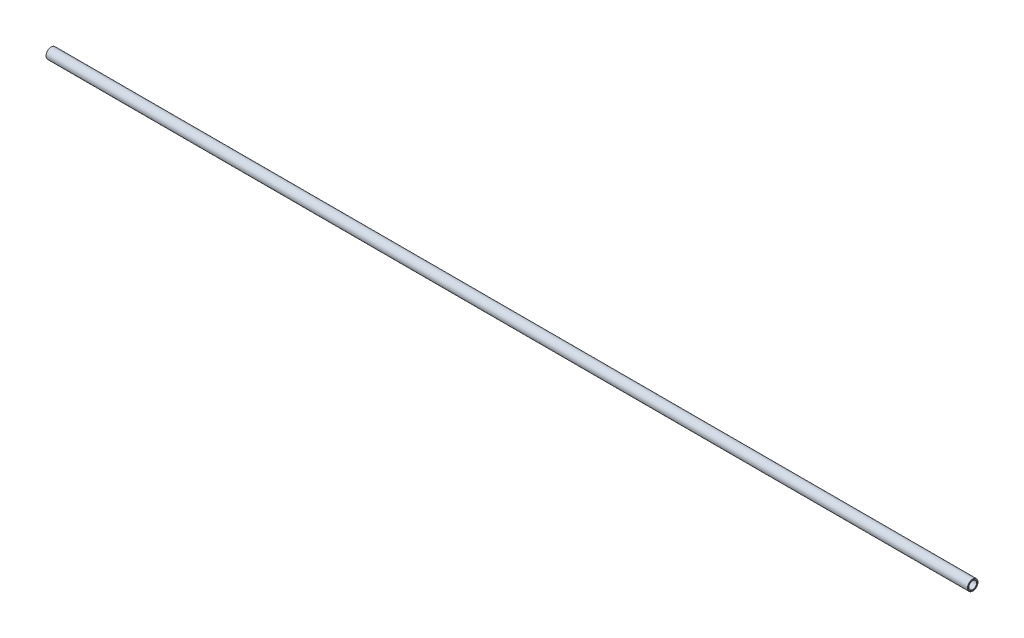
ISO-10303-21;
HEADER;
FILE_DESCRIPTION(('STEP AP214'),'2;1');
FILE_NAME('part.step','',(''),(''),'','','');
FILE_SCHEMA(('AUTOMOTIVE_DESIGN { 1 0 10303 214 1 1 1 1 }'));
ENDSEC;
DATA;
#1=APPLICATION_CONTEXT('core data for automotive mechanical design processes');
#2=APPLICATION_PROTOCOL_DEFINITION('international standard','automotive_design',2000,#1);
#3=PRODUCT_CONTEXT('',#1,'mechanical');
#4=PRODUCT('Part','Part','',(#3));
#5=PRODUCT_RELATED_PRODUCT_CATEGORY('part','',(#4));
#6=PRODUCT_DEFINITION_FORMATION('','',#4);
#7=PRODUCT_DEFINITION_CONTEXT('part definition',#1,'design');
#8=PRODUCT_DEFINITION('design','',#6,#7);
#9=PRODUCT_DEFINITION_SHAPE('','',#8);
#10=(LENGTH_UNIT() NAMED_UNIT(*) SI_UNIT(.MILLI.,.METRE.));
#11=(NAMED_UNIT(*) PLANE_ANGLE_UNIT() SI_UNIT($,.RADIAN.));
#12=(NAMED_UNIT(*) SI_UNIT($,.STERADIAN.) SOLID_ANGLE_UNIT());
#13=UNCERTAINTY_MEASURE_WITH_UNIT(LENGTH_MEASURE(1.E-05),#10,'distance_accuracy_value','');
#14=(GEOMETRIC_REPRESENTATION_CONTEXT(3) GLOBAL_UNCERTAINTY_ASSIGNED_CONTEXT((#13)) GLOBAL_UNIT_ASSIGNED_CONTEXT((#10,
#11,#12)) REPRESENTATION_CONTEXT('',''));
#15=CARTESIAN_POINT('',(0.,0.,0.));
#16=DIRECTION('',(0.,0.,1.));
#17=DIRECTION('',(1.,0.,0.));
#18=AXIS2_PLACEMENT_3D('',#15,#16,#17);
#19=CARTESIAN_POINT('',(2235.2,0.,0.));
#20=DIRECTION('',(1.,0.,0.));
#21=DIRECTION('',(0.,0.,-1.));
#22=AXIS2_PLACEMENT_3D('',#19,#20,#21);
#23=PLANE('',#22);
#24=CARTESIAN_POINT('',(2235.2,0.,0.));
#25=DIRECTION('',(1.,0.,0.));
#26=DIRECTION('',(0.,0.,-1.));
#27=AXIS2_PLACEMENT_3D('',#24,#25,#26);
#28=CIRCLE('',#27,12.192);
#29=CARTESIAN_POINT('',(2235.2,0.,-12.192));
#30=VERTEX_POINT('',#29);
#31=EDGE_CURVE('E10',#30,#30,#28,.T.);
#32=ORIENTED_EDGE('',*,*,#31,.T.);
#33=EDGE_LOOP('',(#32));
#34=FACE_BOUND('',#33,.T.);
#35=CARTESIAN_POINT('',(2235.2,0.,0.));
#36=DIRECTION('',(1.,0.,0.));
#37=DIRECTION('',(0.,0.,-1.));
#38=AXIS2_PLACEMENT_3D('',#35,#36,#37);
#39=CIRCLE('',#38,10.0330000000004);
#40=CARTESIAN_POINT('',(2235.2,0.,-10.0330000000004));
#41=VERTEX_POINT('',#40);
#42=EDGE_CURVE('E42',#41,#41,#39,.F.);
#43=ORIENTED_EDGE('',*,*,#42,.T.);
#44=EDGE_LOOP('',(#43));
#45=FACE_BOUND('',#44,.T.);
#46=ADVANCED_FACE('F34',(#34,#45),#23,.T.);
#47=CARTESIAN_POINT('',(0.,0.,0.));
#48=DIRECTION('',(1.,0.,0.));
#49=DIRECTION('',(0.,0.,-1.));
#50=AXIS2_PLACEMENT_3D('',#47,#48,#49);
#51=PLANE('',#50);
#52=CARTESIAN_POINT('',(0.,0.,0.));
#53=DIRECTION('',(1.,0.,0.));
#54=DIRECTION('',(0.,0.,-1.));
#55=AXIS2_PLACEMENT_3D('',#52,#53,#54);
#56=CIRCLE('',#55,10.0330000000002);
#57=CARTESIAN_POINT('',(0.,0.,-10.0330000000002));
#58=VERTEX_POINT('',#57);
#59=EDGE_CURVE('E61',#58,#58,#56,.T.);
#60=ORIENTED_EDGE('',*,*,#59,.T.);
#61=EDGE_LOOP('',(#60));
#62=FACE_BOUND('',#61,.T.);
#63=CARTESIAN_POINT('',(0.,0.,0.));
#64=DIRECTION('',(1.,0.,0.));
#65=DIRECTION('',(0.,0.,-1.));
#66=AXIS2_PLACEMENT_3D('',#63,#64,#65);
#67=CIRCLE('',#66,12.1919999999998);
#68=CARTESIAN_POINT('',(0.,0.,-12.1919999999998));
#69=VERTEX_POINT('',#68);
#70=EDGE_CURVE('E64',#69,#69,#67,.F.);
#71=ORIENTED_EDGE('',*,*,#70,.T.);
#72=EDGE_LOOP('',(#71));
#73=FACE_BOUND('',#72,.T.);
#74=ADVANCED_FACE('F68',(#62,#73),#51,.F.);
#75=CARTESIAN_POINT('',(2235.2,0.,0.));
#76=DIRECTION('',(-1.,0.,0.));
#77=DIRECTION('',(0.,0.,1.));
#78=AXIS2_PLACEMENT_3D('',#75,#76,#77);
#79=CYLINDRICAL_SURFACE('',#78,12.7);
#80=CARTESIAN_POINT('',(0.508000000000397,0.,0.));
#81=DIRECTION('',(1.,0.,0.));
#82=DIRECTION('',(0.,0.,-1.));
#83=AXIS2_PLACEMENT_3D('',#80,#81,#82);
#84=CIRCLE('',#83,12.7);
#85=CARTESIAN_POINT('',(0.508000000000397,0.,-12.7));
#86=VERTEX_POINT('',#85);
#87=EDGE_CURVE('E46',#86,#86,#84,.T.);
#88=ORIENTED_EDGE('',*,*,#87,.T.);
#89=EDGE_LOOP('',(#88));
#90=FACE_BOUND('',#89,.T.);
#91=CARTESIAN_POINT('',(2234.692,0.,0.));
#92=DIRECTION('',(1.,0.,0.));
#93=DIRECTION('',(0.,0.,-1.));
#94=AXIS2_PLACEMENT_3D('',#91,#92,#93);
#95=CIRCLE('',#94,12.7);
#96=CARTESIAN_POINT('',(2234.692,0.,-12.7));
#97=VERTEX_POINT('',#96);
#98=EDGE_CURVE('E50',#97,#97,#95,.F.);
#99=ORIENTED_EDGE('',*,*,#98,.T.);
#100=EDGE_LOOP('',(#99));
#101=FACE_BOUND('',#100,.T.);
#102=ADVANCED_FACE('F78',(#90,#101),#79,.T.);
#103=CARTESIAN_POINT('',(2235.2,0.,0.));
#104=DIRECTION('',(-1.,0.,0.));
#105=DIRECTION('',(0.,0.,1.));
#106=AXIS2_PLACEMENT_3D('',#103,#104,#105);
#107=CYLINDRICAL_SURFACE('',#106,9.525);
#108=CARTESIAN_POINT('',(0.507999999999953,0.,0.));
#109=DIRECTION('',(1.,0.,0.));
#110=DIRECTION('',(0.,0.,-1.));
#111=AXIS2_PLACEMENT_3D('',#108,#109,#110);
#112=CIRCLE('',#111,9.525);
#113=CARTESIAN_POINT('',(0.507999999999953,0.,-9.525));
#114=VERTEX_POINT('',#113);
#115=EDGE_CURVE('E55',#114,#114,#112,.F.);
#116=ORIENTED_EDGE('',*,*,#115,.T.);
#117=EDGE_LOOP('',(#116));
#118=FACE_BOUND('',#117,.T.);
#119=CARTESIAN_POINT('',(2234.692,0.,0.));
#120=DIRECTION('',(1.,0.,0.));
#121=DIRECTION('',(0.,0.,-1.));
#122=AXIS2_PLACEMENT_3D('',#119,#120,#121);
#123=CIRCLE('',#122,9.525);
#124=CARTESIAN_POINT('',(2234.692,0.,-9.525));
#125=VERTEX_POINT('',#124);
#126=EDGE_CURVE('E58',#125,#125,#123,.T.);
#127=ORIENTED_EDGE('',*,*,#126,.T.);
#128=EDGE_LOOP('',(#127));
#129=FACE_BOUND('',#128,.T.);
#130=ADVANCED_FACE('F81',(#118,#129),#107,.F.);
#131=CARTESIAN_POINT('',(0.,0.,0.));
#132=DIRECTION('',(-1.,0.,0.));
#133=DIRECTION('',(0.,0.,1.));
#134=AXIS2_PLACEMENT_3D('',#131,#132,#133);
#135=CONICAL_SURFACE('',#134,10.0330000000002,0.785398163397674);
#136=ORIENTED_EDGE('',*,*,#115,.F.);
#137=EDGE_LOOP('',(#136));
#138=FACE_BOUND('',#137,.T.);
#139=ORIENTED_EDGE('',*,*,#59,.F.);
#140=EDGE_LOOP('',(#139));
#141=FACE_BOUND('',#140,.T.);
#142=ADVANCED_FACE('F74',(#138,#141),#135,.F.);
#143=CARTESIAN_POINT('',(0.508000000000397,0.,0.));
#144=DIRECTION('',(1.,0.,0.));
#145=DIRECTION('',(0.,0.,-1.));
#146=AXIS2_PLACEMENT_3D('',#143,#144,#145);
#147=CONICAL_SURFACE('',#146,12.7,0.785398163397293);
#148=ORIENTED_EDGE('',*,*,#70,.F.);
#149=EDGE_LOOP('',(#148));
#150=FACE_BOUND('',#149,.T.);
#151=ORIENTED_EDGE('',*,*,#87,.F.);
#152=EDGE_LOOP('',(#151));
#153=FACE_BOUND('',#152,.T.);
#154=ADVANCED_FACE('F70',(#150,#153),#147,.T.);
#155=CARTESIAN_POINT('',(2235.2,0.,0.));
#156=DIRECTION('',(-1.,0.,0.));
#157=DIRECTION('',(0.,0.,1.));
#158=AXIS2_PLACEMENT_3D('',#155,#156,#157);
#159=CONICAL_SURFACE('',#158,12.192,0.785398163397076);
#160=ORIENTED_EDGE('',*,*,#98,.F.);
#161=EDGE_LOOP('',(#160));
#162=FACE_BOUND('',#161,.T.);
#163=ORIENTED_EDGE('',*,*,#31,.F.);
#164=EDGE_LOOP('',(#163));
#165=FACE_BOUND('',#164,.T.);
#166=ADVANCED_FACE('F73',(#162,#165),#159,.T.);
#167=CARTESIAN_POINT('',(2234.692,0.,0.));
#168=DIRECTION('',(1.,0.,0.));
#169=DIRECTION('',(0.,0.,-1.));
#170=AXIS2_PLACEMENT_3D('',#167,#168,#169);
#171=CONICAL_SURFACE('',#170,9.525,0.785398163397455);
#172=ORIENTED_EDGE('',*,*,#42,.F.);
#173=EDGE_LOOP('',(#172));
#174=FACE_BOUND('',#173,.T.);
#175=ORIENTED_EDGE('',*,*,#126,.F.);
#176=EDGE_LOOP('',(#175));
#177=FACE_BOUND('',#176,.T.);
#178=ADVANCED_FACE('F37',(#174,#177),#171,.F.);
#179=CLOSED_SHELL('',(#46,#74,#102,#130,#142,#154,#166,#178));
#180=MANIFOLD_SOLID_BREP('B2',#179);
#181=ADVANCED_BREP_SHAPE_REPRESENTATION('',(#18,#180),#14);
#182=SHAPE_DEFINITION_REPRESENTATION(#9,#181);
ENDSEC;
END-ISO-10303-21;
